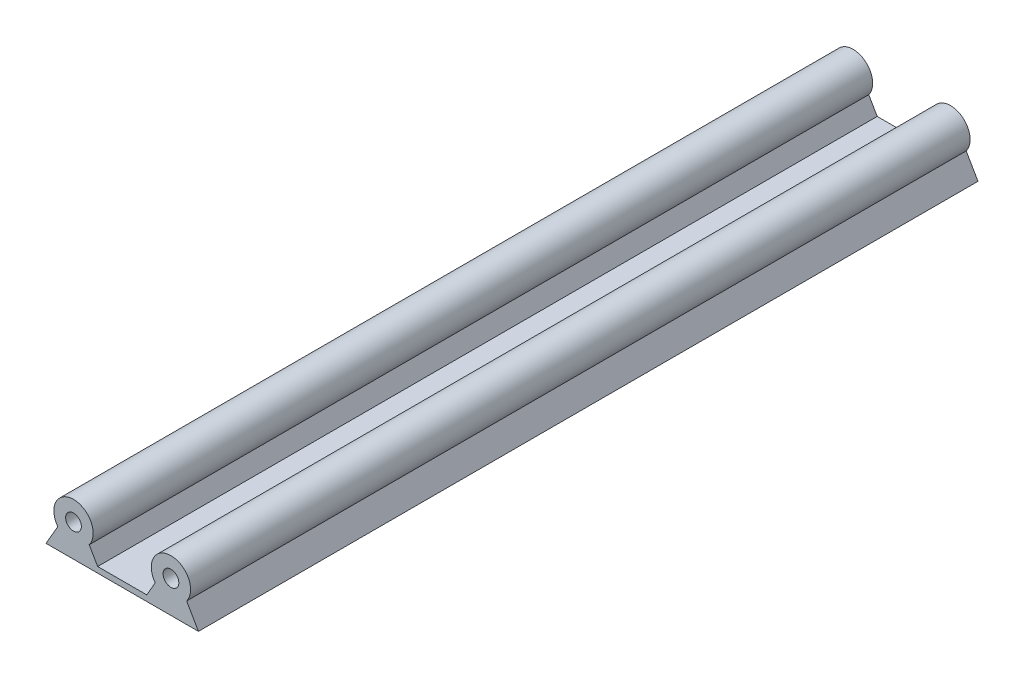
ISO-10303-21;
HEADER;
FILE_DESCRIPTION(('STEP AP214'),'2;1');
FILE_NAME('part.step','',(''),(''),'','','');
FILE_SCHEMA(('AUTOMOTIVE_DESIGN { 1 0 10303 214 1 1 1 1 }'));
ENDSEC;
DATA;
#1=APPLICATION_CONTEXT('core data for automotive mechanical design processes');
#2=APPLICATION_PROTOCOL_DEFINITION('international standard','automotive_design',2000,#1);
#3=PRODUCT_CONTEXT('',#1,'mechanical');
#4=PRODUCT('Part','Part','',(#3));
#5=PRODUCT_RELATED_PRODUCT_CATEGORY('part','',(#4));
#6=PRODUCT_DEFINITION_FORMATION('','',#4);
#7=PRODUCT_DEFINITION_CONTEXT('part definition',#1,'design');
#8=PRODUCT_DEFINITION('design','',#6,#7);
#9=PRODUCT_DEFINITION_SHAPE('','',#8);
#10=(LENGTH_UNIT() NAMED_UNIT(*) SI_UNIT(.MILLI.,.METRE.));
#11=(NAMED_UNIT(*) PLANE_ANGLE_UNIT() SI_UNIT($,.RADIAN.));
#12=(NAMED_UNIT(*) SI_UNIT($,.STERADIAN.) SOLID_ANGLE_UNIT());
#13=UNCERTAINTY_MEASURE_WITH_UNIT(LENGTH_MEASURE(1.E-05),#10,'distance_accuracy_value','');
#14=(GEOMETRIC_REPRESENTATION_CONTEXT(3) GLOBAL_UNCERTAINTY_ASSIGNED_CONTEXT((#13)) GLOBAL_UNIT_ASSIGNED_CONTEXT((#10,
#11,#12)) REPRESENTATION_CONTEXT('',''));
#15=CARTESIAN_POINT('',(0.,0.,0.));
#16=DIRECTION('',(0.,0.,1.));
#17=DIRECTION('',(1.,0.,0.));
#18=AXIS2_PLACEMENT_3D('',#15,#16,#17);
#19=CARTESIAN_POINT('',(0.,0.,220.));
#20=DIRECTION('',(0.,0.,-1.));
#21=DIRECTION('',(-1.,0.,0.));
#22=AXIS2_PLACEMENT_3D('',#19,#20,#21);
#23=CYLINDRICAL_SURFACE('',#22,5.);
#24=CARTESIAN_POINT('',(0.,0.,209.2));
#25=DIRECTION('',(0.,0.,1.));
#26=DIRECTION('',(1.,0.,0.));
#27=AXIS2_PLACEMENT_3D('',#24,#25,#26);
#28=CIRCLE('',#27,5.);
#29=CARTESIAN_POINT('',(4.,-3.,209.2));
#30=VERTEX_POINT('',#29);
#31=CARTESIAN_POINT('',(-4.,-3.,209.2));
#32=VERTEX_POINT('',#31);
#33=EDGE_CURVE('E198',#30,#32,#28,.T.);
#34=ORIENTED_EDGE('',*,*,#33,.F.);
#35=DIRECTION('',(0.,0.,-1.));
#36=VECTOR('',#35,1.);
#37=CARTESIAN_POINT('',(4.,-3.,220.));
#38=LINE('',#37,#36);
#39=CARTESIAN_POINT('',(4.,-3.,10.8));
#40=VERTEX_POINT('',#39);
#41=EDGE_CURVE('E148',#30,#40,#38,.T.);
#42=ORIENTED_EDGE('',*,*,#41,.T.);
#43=CARTESIAN_POINT('',(0.,0.,10.8));
#44=DIRECTION('',(0.,0.,-1.));
#45=DIRECTION('',(-1.,0.,0.));
#46=AXIS2_PLACEMENT_3D('',#43,#44,#45);
#47=CIRCLE('',#46,5.);
#48=CARTESIAN_POINT('',(-4.,-3.,10.8));
#49=VERTEX_POINT('',#48);
#50=EDGE_CURVE('E177',#49,#40,#47,.T.);
#51=ORIENTED_EDGE('',*,*,#50,.F.);
#52=DIRECTION('',(0.,0.,-1.));
#53=VECTOR('',#52,1.);
#54=CARTESIAN_POINT('',(-4.,-3.,220.));
#55=LINE('',#54,#53);
#56=EDGE_CURVE('E11',#32,#49,#55,.T.);
#57=ORIENTED_EDGE('',*,*,#56,.F.);
#58=EDGE_LOOP('',(#34,#42,#51,#57));
#59=FACE_BOUND('',#58,.T.);
#60=ADVANCED_FACE('F47',(#59),#23,.T.);
#61=CARTESIAN_POINT('',(-1.70096189432334,0.982050807568877,220.));
#62=DIRECTION('',(0.866025403784438,-0.5,0.));
#63=DIRECTION('',(0.5,0.866025403784439,0.));
#64=AXIS2_PLACEMENT_3D('',#61,#62,#63);
#65=PLANE('',#64);
#66=DIRECTION('',(-0.5,-0.866025403784439,0.));
#67=VECTOR('',#66,1.);
#68=CARTESIAN_POINT('',(-4.,-3.,209.2));
#69=LINE('',#68,#67);
#70=CARTESIAN_POINT('',(-7.,-8.19615242270663,209.2));
#71=VERTEX_POINT('',#70);
#72=EDGE_CURVE('E203',#32,#71,#69,.T.);
#73=ORIENTED_EDGE('',*,*,#72,.F.);
#74=ORIENTED_EDGE('',*,*,#56,.T.);
#75=DIRECTION('',(0.5,0.866025403784439,0.));
#76=VECTOR('',#75,1.);
#77=CARTESIAN_POINT('',(-7.,-8.19615242270663,10.8));
#78=LINE('',#77,#76);
#79=CARTESIAN_POINT('',(-7.,-8.19615242270663,10.8));
#80=VERTEX_POINT('',#79);
#81=EDGE_CURVE('E168',#80,#49,#78,.T.);
#82=ORIENTED_EDGE('',*,*,#81,.F.);
#83=DIRECTION('',(0.,0.,-1.));
#84=VECTOR('',#83,1.);
#85=CARTESIAN_POINT('',(-7.,-8.19615242270663,220.));
#86=LINE('',#85,#84);
#87=EDGE_CURVE('E55',#71,#80,#86,.T.);
#88=ORIENTED_EDGE('',*,*,#87,.F.);
#89=EDGE_LOOP('',(#73,#74,#82,#88));
#90=FACE_BOUND('',#89,.T.);
#91=ADVANCED_FACE('F174',(#90),#65,.F.);
#92=CARTESIAN_POINT('',(0.,-8.19615242270663,220.));
#93=DIRECTION('',(0.,1.,0.));
#94=DIRECTION('',(0.,0.,1.));
#95=AXIS2_PLACEMENT_3D('',#92,#93,#94);
#96=PLANE('',#95);
#97=CARTESIAN_POINT('',(24.8000000000093,-8.19615242270663,23.2000000000003));
#98=DIRECTION('',(0.,-1.,0.));
#99=DIRECTION('',(0.,0.,-1.));
#100=AXIS2_PLACEMENT_3D('',#97,#98,#99);
#101=CIRCLE('',#100,3.2);
#102=CARTESIAN_POINT('',(24.8000000000093,-8.19615242270663,20.0000000000003));
#103=VERTEX_POINT('',#102);
#104=EDGE_CURVE('E250',#103,#103,#101,.T.);
#105=ORIENTED_EDGE('',*,*,#104,.F.);
#106=EDGE_LOOP('',(#105));
#107=FACE_BOUND('',#106,.T.);
#108=CARTESIAN_POINT('',(0.,-8.19615242270663,198.2));
#109=DIRECTION('',(0.,-1.,0.));
#110=DIRECTION('',(0.,0.,-1.));
#111=AXIS2_PLACEMENT_3D('',#108,#109,#110);
#112=CIRCLE('',#111,3.20000000000001);
#113=CARTESIAN_POINT('',(0.,-8.19615242270663,195.));
#114=VERTEX_POINT('',#113);
#115=EDGE_CURVE('E254',#114,#114,#112,.T.);
#116=ORIENTED_EDGE('',*,*,#115,.F.);
#117=EDGE_LOOP('',(#116));
#118=FACE_BOUND('',#117,.T.);
#119=CARTESIAN_POINT('',(24.8,-8.19615242270663,198.2));
#120=DIRECTION('',(0.,-1.,0.));
#121=DIRECTION('',(0.,0.,-1.));
#122=AXIS2_PLACEMENT_3D('',#119,#120,#121);
#123=CIRCLE('',#122,3.2);
#124=CARTESIAN_POINT('',(24.8,-8.19615242270663,195.));
#125=VERTEX_POINT('',#124);
#126=EDGE_CURVE('E258',#125,#125,#123,.T.);
#127=ORIENTED_EDGE('',*,*,#126,.F.);
#128=EDGE_LOOP('',(#127));
#129=FACE_BOUND('',#128,.T.);
#130=CARTESIAN_POINT('',(9.28301076888116E-12,-8.19615242270663,23.2));
#131=DIRECTION('',(0.,-1.,0.));
#132=DIRECTION('',(0.,0.,-1.));
#133=AXIS2_PLACEMENT_3D('',#130,#131,#132);
#134=CIRCLE('',#133,3.2);
#135=CARTESIAN_POINT('',(9.28301076888116E-12,-8.19615242270663,20.));
#136=VERTEX_POINT('',#135);
#137=EDGE_CURVE('E261',#136,#136,#134,.T.);
#138=ORIENTED_EDGE('',*,*,#137,.F.);
#139=EDGE_LOOP('',(#138));
#140=FACE_BOUND('',#139,.T.);
#141=DIRECTION('',(1.,0.,0.));
#142=VECTOR('',#141,1.);
#143=CARTESIAN_POINT('',(-7.,-8.19615242270663,209.2));
#144=LINE('',#143,#142);
#145=CARTESIAN_POINT('',(31.8,-8.19615242270663,209.2));
#146=VERTEX_POINT('',#145);
#147=EDGE_CURVE('E62',#71,#146,#144,.T.);
#148=ORIENTED_EDGE('',*,*,#147,.F.);
#149=ORIENTED_EDGE('',*,*,#87,.T.);
#150=DIRECTION('',(-1.,0.,0.));
#151=VECTOR('',#150,1.);
#152=CARTESIAN_POINT('',(31.8,-8.19615242270663,10.8));
#153=LINE('',#152,#151);
#154=CARTESIAN_POINT('',(31.8,-8.19615242270663,10.8));
#155=VERTEX_POINT('',#154);
#156=EDGE_CURVE('E159',#155,#80,#153,.T.);
#157=ORIENTED_EDGE('',*,*,#156,.F.);
#158=DIRECTION('',(0.,0.,-1.));
#159=VECTOR('',#158,1.);
#160=CARTESIAN_POINT('',(31.8,-8.19615242270663,220.));
#161=LINE('',#160,#159);
#162=EDGE_CURVE('E134',#146,#155,#161,.T.);
#163=ORIENTED_EDGE('',*,*,#162,.F.);
#164=EDGE_LOOP('',(#148,#149,#157,#163));
#165=FACE_BOUND('',#164,.T.);
#166=ADVANCED_FACE('F157',(#107,#118,#129,#140,#165),#96,.F.);
#167=CARTESIAN_POINT('',(1.70096189432334,0.982050807568877,220.));
#168=DIRECTION('',(0.866025403784438,0.5,0.));
#169=DIRECTION('',(-0.5,0.866025403784439,0.));
#170=AXIS2_PLACEMENT_3D('',#167,#168,#169);
#171=PLANE('',#170);
#172=ORIENTED_EDGE('',*,*,#41,.F.);
#173=DIRECTION('',(-0.5,0.866025403784439,0.));
#174=VECTOR('',#173,1.);
#175=CARTESIAN_POINT('',(6.15,-6.72390923627308,209.2));
#176=LINE('',#175,#174);
#177=CARTESIAN_POINT('',(6.15,-6.72390923627308,209.2));
#178=VERTEX_POINT('',#177);
#179=EDGE_CURVE('E195',#178,#30,#176,.T.);
#180=ORIENTED_EDGE('',*,*,#179,.F.);
#181=DIRECTION('',(0.,0.,1.));
#182=VECTOR('',#181,1.);
#183=CARTESIAN_POINT('',(6.15,-6.72390923627308,0.));
#184=LINE('',#183,#182);
#185=CARTESIAN_POINT('',(6.15,-6.72390923627308,10.8));
#186=VERTEX_POINT('',#185);
#187=EDGE_CURVE('E144',#186,#178,#184,.T.);
#188=ORIENTED_EDGE('',*,*,#187,.F.);
#189=DIRECTION('',(0.5,-0.866025403784439,0.));
#190=VECTOR('',#189,1.);
#191=CARTESIAN_POINT('',(4.,-3.,10.8));
#192=LINE('',#191,#190);
#193=EDGE_CURVE('E180',#40,#186,#192,.T.);
#194=ORIENTED_EDGE('',*,*,#193,.F.);
#195=EDGE_LOOP('',(#172,#180,#188,#194));
#196=FACE_BOUND('',#195,.T.);
#197=ADVANCED_FACE('F233',(#196),#171,.T.);
#198=CARTESIAN_POINT('',(6.15,-6.72390923627308,0.));
#199=DIRECTION('',(0.,1.,0.));
#200=DIRECTION('',(-1.,0.,0.));
#201=AXIS2_PLACEMENT_3D('',#198,#199,#200);
#202=PLANE('',#201);
#203=ORIENTED_EDGE('',*,*,#187,.T.);
#204=DIRECTION('',(-1.,0.,0.));
#205=VECTOR('',#204,1.);
#206=CARTESIAN_POINT('',(18.65,-6.72390923627309,209.2));
#207=LINE('',#206,#205);
#208=CARTESIAN_POINT('',(18.65,-6.72390923627309,209.2));
#209=VERTEX_POINT('',#208);
#210=EDGE_CURVE('E129',#209,#178,#207,.T.);
#211=ORIENTED_EDGE('',*,*,#210,.F.);
#212=DIRECTION('',(0.,0.,1.));
#213=VECTOR('',#212,1.);
#214=CARTESIAN_POINT('',(18.65,-6.72390923627309,0.));
#215=LINE('',#214,#213);
#216=CARTESIAN_POINT('',(18.65,-6.72390923627309,10.8));
#217=VERTEX_POINT('',#216);
#218=EDGE_CURVE('E127',#217,#209,#215,.T.);
#219=ORIENTED_EDGE('',*,*,#218,.F.);
#220=DIRECTION('',(1.,0.,0.));
#221=VECTOR('',#220,1.);
#222=CARTESIAN_POINT('',(6.15,-6.72390923627308,10.8));
#223=LINE('',#222,#221);
#224=EDGE_CURVE('E140',#186,#217,#223,.T.);
#225=ORIENTED_EDGE('',*,*,#224,.F.);
#226=EDGE_LOOP('',(#203,#211,#219,#225));
#227=FACE_BOUND('',#226,.T.);
#228=ADVANCED_FACE('F192',(#227),#202,.T.);
#229=CARTESIAN_POINT('',(24.8,0.,220.));
#230=DIRECTION('',(0.,0.,-1.));
#231=DIRECTION('',(-1.,0.,0.));
#232=AXIS2_PLACEMENT_3D('',#229,#230,#231);
#233=CYLINDRICAL_SURFACE('',#232,5.);
#234=DIRECTION('',(0.,0.,-1.));
#235=VECTOR('',#234,1.);
#236=CARTESIAN_POINT('',(20.8,-3.,220.));
#237=LINE('',#236,#235);
#238=CARTESIAN_POINT('',(20.8,-3.,209.2));
#239=VERTEX_POINT('',#238);
#240=CARTESIAN_POINT('',(20.8,-3.,10.8));
#241=VERTEX_POINT('',#240);
#242=EDGE_CURVE('E124',#239,#241,#237,.T.);
#243=ORIENTED_EDGE('',*,*,#242,.F.);
#244=CARTESIAN_POINT('',(24.8,0.,209.2));
#245=DIRECTION('',(0.,0.,1.));
#246=DIRECTION('',(1.,0.,0.));
#247=AXIS2_PLACEMENT_3D('',#244,#245,#246);
#248=CIRCLE('',#247,5.);
#249=CARTESIAN_POINT('',(28.8,-3.,209.2));
#250=VERTEX_POINT('',#249);
#251=EDGE_CURVE('E110',#250,#239,#248,.T.);
#252=ORIENTED_EDGE('',*,*,#251,.F.);
#253=DIRECTION('',(0.,0.,-1.));
#254=VECTOR('',#253,1.);
#255=CARTESIAN_POINT('',(28.8,-3.,220.));
#256=LINE('',#255,#254);
#257=CARTESIAN_POINT('',(28.8,-3.,10.8));
#258=VERTEX_POINT('',#257);
#259=EDGE_CURVE('E70',#250,#258,#256,.T.);
#260=ORIENTED_EDGE('',*,*,#259,.T.);
#261=CARTESIAN_POINT('',(24.8,0.,10.8));
#262=DIRECTION('',(0.,0.,-1.));
#263=DIRECTION('',(-1.,0.,0.));
#264=AXIS2_PLACEMENT_3D('',#261,#262,#263);
#265=CIRCLE('',#264,5.);
#266=EDGE_CURVE('E132',#241,#258,#265,.T.);
#267=ORIENTED_EDGE('',*,*,#266,.F.);
#268=EDGE_LOOP('',(#243,#252,#260,#267));
#269=FACE_BOUND('',#268,.T.);
#270=ADVANCED_FACE('F131',(#269),#233,.T.);
#271=CARTESIAN_POINT('',(20.8,-3.,220.));
#272=DIRECTION('',(0.866025403784439,-0.5,0.));
#273=DIRECTION('',(0.5,0.866025403784439,0.));
#274=AXIS2_PLACEMENT_3D('',#271,#272,#273);
#275=PLANE('',#274);
#276=DIRECTION('',(-0.5,-0.866025403784439,0.));
#277=VECTOR('',#276,1.);
#278=CARTESIAN_POINT('',(20.8,-3.,209.2));
#279=LINE('',#278,#277);
#280=EDGE_CURVE('E113',#239,#209,#279,.T.);
#281=ORIENTED_EDGE('',*,*,#280,.F.);
#282=ORIENTED_EDGE('',*,*,#242,.T.);
#283=DIRECTION('',(0.5,0.866025403784439,0.));
#284=VECTOR('',#283,1.);
#285=CARTESIAN_POINT('',(18.65,-6.72390923627309,10.8));
#286=LINE('',#285,#284);
#287=EDGE_CURVE('E135',#217,#241,#286,.T.);
#288=ORIENTED_EDGE('',*,*,#287,.F.);
#289=ORIENTED_EDGE('',*,*,#218,.T.);
#290=EDGE_LOOP('',(#281,#282,#288,#289));
#291=FACE_BOUND('',#290,.T.);
#292=ADVANCED_FACE('F122',(#291),#275,.F.);
#293=CARTESIAN_POINT('',(28.8,-3.,220.));
#294=DIRECTION('',(0.866025403784438,0.5,0.));
#295=DIRECTION('',(-0.5,0.866025403784438,0.));
#296=AXIS2_PLACEMENT_3D('',#293,#294,#295);
#297=PLANE('',#296);
#298=ORIENTED_EDGE('',*,*,#259,.F.);
#299=DIRECTION('',(-0.5,0.866025403784438,0.));
#300=VECTOR('',#299,1.);
#301=CARTESIAN_POINT('',(31.8,-8.19615242270663,209.2));
#302=LINE('',#301,#300);
#303=EDGE_CURVE('E115',#146,#250,#302,.T.);
#304=ORIENTED_EDGE('',*,*,#303,.F.);
#305=ORIENTED_EDGE('',*,*,#162,.T.);
#306=DIRECTION('',(0.5,-0.866025403784438,0.));
#307=VECTOR('',#306,1.);
#308=CARTESIAN_POINT('',(28.8,-3.,10.8));
#309=LINE('',#308,#307);
#310=EDGE_CURVE('E171',#258,#155,#309,.T.);
#311=ORIENTED_EDGE('',*,*,#310,.F.);
#312=EDGE_LOOP('',(#298,#304,#305,#311));
#313=FACE_BOUND('',#312,.T.);
#314=ADVANCED_FACE('F213',(#313),#297,.T.);
#315=CARTESIAN_POINT('',(24.8,0.,10.8));
#316=DIRECTION('',(0.,0.,-1.));
#317=DIRECTION('',(-1.,0.,0.));
#318=AXIS2_PLACEMENT_3D('',#315,#316,#317);
#319=PLANE('',#318);
#320=CARTESIAN_POINT('',(0.,0.,10.8));
#321=DIRECTION('',(0.,0.,-1.));
#322=DIRECTION('',(-1.,0.,0.));
#323=AXIS2_PLACEMENT_3D('',#320,#321,#322);
#324=CIRCLE('',#323,1.5);
#325=CARTESIAN_POINT('',(-1.5,0.,10.8));
#326=VERTEX_POINT('',#325);
#327=EDGE_CURVE('E281',#326,#326,#324,.T.);
#328=ORIENTED_EDGE('',*,*,#327,.F.);
#329=EDGE_LOOP('',(#328));
#330=FACE_BOUND('',#329,.T.);
#331=CARTESIAN_POINT('',(24.8,-1.73177474406619E-13,10.8));
#332=DIRECTION('',(0.,0.,-1.));
#333=DIRECTION('',(-1.,0.,0.));
#334=AXIS2_PLACEMENT_3D('',#331,#332,#333);
#335=CIRCLE('',#334,1.5);
#336=CARTESIAN_POINT('',(23.3,-1.73177474406619E-13,10.8));
#337=VERTEX_POINT('',#336);
#338=EDGE_CURVE('E285',#337,#337,#335,.T.);
#339=ORIENTED_EDGE('',*,*,#338,.F.);
#340=EDGE_LOOP('',(#339));
#341=FACE_BOUND('',#340,.T.);
#342=ORIENTED_EDGE('',*,*,#266,.T.);
#343=ORIENTED_EDGE('',*,*,#310,.T.);
#344=ORIENTED_EDGE('',*,*,#156,.T.);
#345=ORIENTED_EDGE('',*,*,#81,.T.);
#346=ORIENTED_EDGE('',*,*,#50,.T.);
#347=ORIENTED_EDGE('',*,*,#193,.T.);
#348=ORIENTED_EDGE('',*,*,#224,.T.);
#349=ORIENTED_EDGE('',*,*,#287,.T.);
#350=EDGE_LOOP('',(#342,#343,#344,#345,#346,#347,#348,#349));
#351=FACE_BOUND('',#350,.T.);
#352=ADVANCED_FACE('F166',(#330,#341,#351),#319,.T.);
#353=CARTESIAN_POINT('',(24.8,0.,209.2));
#354=DIRECTION('',(0.,0.,1.));
#355=DIRECTION('',(1.,0.,0.));
#356=AXIS2_PLACEMENT_3D('',#353,#354,#355);
#357=PLANE('',#356);
#358=CARTESIAN_POINT('',(0.,0.,209.2));
#359=DIRECTION('',(0.,0.,1.));
#360=DIRECTION('',(1.,0.,0.));
#361=AXIS2_PLACEMENT_3D('',#358,#359,#360);
#362=CIRCLE('',#361,2.);
#363=CARTESIAN_POINT('',(2.,0.,209.2));
#364=VERTEX_POINT('',#363);
#365=EDGE_CURVE('E295',#364,#364,#362,.T.);
#366=ORIENTED_EDGE('',*,*,#365,.F.);
#367=EDGE_LOOP('',(#366));
#368=FACE_BOUND('',#367,.T.);
#369=CARTESIAN_POINT('',(24.8,0.,209.2));
#370=DIRECTION('',(0.,0.,1.));
#371=DIRECTION('',(1.,0.,0.));
#372=AXIS2_PLACEMENT_3D('',#369,#370,#371);
#373=CIRCLE('',#372,2.);
#374=CARTESIAN_POINT('',(26.8,0.,209.2));
#375=VERTEX_POINT('',#374);
#376=EDGE_CURVE('E299',#375,#375,#373,.T.);
#377=ORIENTED_EDGE('',*,*,#376,.F.);
#378=EDGE_LOOP('',(#377));
#379=FACE_BOUND('',#378,.T.);
#380=ORIENTED_EDGE('',*,*,#251,.T.);
#381=ORIENTED_EDGE('',*,*,#280,.T.);
#382=ORIENTED_EDGE('',*,*,#210,.T.);
#383=ORIENTED_EDGE('',*,*,#179,.T.);
#384=ORIENTED_EDGE('',*,*,#33,.T.);
#385=ORIENTED_EDGE('',*,*,#72,.T.);
#386=ORIENTED_EDGE('',*,*,#147,.T.);
#387=ORIENTED_EDGE('',*,*,#303,.T.);
#388=EDGE_LOOP('',(#380,#381,#382,#383,#384,#385,#386,#387));
#389=FACE_BOUND('',#388,.T.);
#390=ADVANCED_FACE('F112',(#368,#379,#389),#357,.T.);
#391=CARTESIAN_POINT('',(24.8,0.,202.2));
#392=DIRECTION('',(0.,0.,1.));
#393=DIRECTION('',(1.,0.,0.));
#394=AXIS2_PLACEMENT_3D('',#391,#392,#393);
#395=CYLINDRICAL_SURFACE('',#394,2.);
#396=CARTESIAN_POINT('',(24.8,0.,202.2));
#397=DIRECTION('',(0.,0.,1.));
#398=DIRECTION('',(1.,0.,0.));
#399=AXIS2_PLACEMENT_3D('',#396,#397,#398);
#400=CIRCLE('',#399,2.);
#401=CARTESIAN_POINT('',(26.8,0.,202.2));
#402=VERTEX_POINT('',#401);
#403=EDGE_CURVE('E280',#402,#402,#400,.T.);
#404=ORIENTED_EDGE('',*,*,#403,.F.);
#405=EDGE_LOOP('',(#404));
#406=FACE_BOUND('',#405,.T.);
#407=ORIENTED_EDGE('',*,*,#376,.T.);
#408=EDGE_LOOP('',(#407));
#409=FACE_BOUND('',#408,.T.);
#410=ADVANCED_FACE('F309',(#406,#409),#395,.F.);
#411=CARTESIAN_POINT('',(24.8,0.,202.2));
#412=DIRECTION('',(0.,0.,1.));
#413=DIRECTION('',(1.,0.,0.));
#414=AXIS2_PLACEMENT_3D('',#411,#412,#413);
#415=PLANE('',#414);
#416=ORIENTED_EDGE('',*,*,#403,.T.);
#417=EDGE_LOOP('',(#416));
#418=FACE_BOUND('',#417,.T.);
#419=ADVANCED_FACE('F307',(#418),#415,.T.);
#420=CARTESIAN_POINT('',(0.,0.,202.2));
#421=DIRECTION('',(0.,0.,1.));
#422=DIRECTION('',(1.,0.,0.));
#423=AXIS2_PLACEMENT_3D('',#420,#421,#422);
#424=CYLINDRICAL_SURFACE('',#423,2.);
#425=CARTESIAN_POINT('',(0.,0.,202.2));
#426=DIRECTION('',(0.,0.,1.));
#427=DIRECTION('',(1.,0.,0.));
#428=AXIS2_PLACEMENT_3D('',#425,#426,#427);
#429=CIRCLE('',#428,2.);
#430=CARTESIAN_POINT('',(2.,0.,202.2));
#431=VERTEX_POINT('',#430);
#432=EDGE_CURVE('E118',#431,#431,#429,.T.);
#433=ORIENTED_EDGE('',*,*,#432,.F.);
#434=EDGE_LOOP('',(#433));
#435=FACE_BOUND('',#434,.T.);
#436=ORIENTED_EDGE('',*,*,#365,.T.);
#437=EDGE_LOOP('',(#436));
#438=FACE_BOUND('',#437,.T.);
#439=ADVANCED_FACE('F467',(#435,#438),#424,.F.);
#440=CARTESIAN_POINT('',(0.,0.,202.2));
#441=DIRECTION('',(0.,0.,1.));
#442=DIRECTION('',(1.,0.,0.));
#443=AXIS2_PLACEMENT_3D('',#440,#441,#442);
#444=PLANE('',#443);
#445=ORIENTED_EDGE('',*,*,#432,.T.);
#446=EDGE_LOOP('',(#445));
#447=FACE_BOUND('',#446,.T.);
#448=ADVANCED_FACE('F347',(#447),#444,.T.);
#449=CARTESIAN_POINT('',(24.8,-1.73177474406619E-13,17.8));
#450=DIRECTION('',(0.,0.,-1.));
#451=DIRECTION('',(-1.,0.,0.));
#452=AXIS2_PLACEMENT_3D('',#449,#450,#451);
#453=CYLINDRICAL_SURFACE('',#452,1.5);
#454=CARTESIAN_POINT('',(24.8,-1.73177474406619E-13,17.8));
#455=DIRECTION('',(0.,0.,-1.));
#456=DIRECTION('',(-1.,0.,0.));
#457=AXIS2_PLACEMENT_3D('',#454,#455,#456);
#458=CIRCLE('',#457,1.5);
#459=CARTESIAN_POINT('',(23.3,-1.73177474406619E-13,17.8));
#460=VERTEX_POINT('',#459);
#461=EDGE_CURVE('E270',#460,#460,#458,.T.);
#462=ORIENTED_EDGE('',*,*,#461,.F.);
#463=EDGE_LOOP('',(#462));
#464=FACE_BOUND('',#463,.T.);
#465=ORIENTED_EDGE('',*,*,#338,.T.);
#466=EDGE_LOOP('',(#465));
#467=FACE_BOUND('',#466,.T.);
#468=ADVANCED_FACE('F351',(#464,#467),#453,.F.);
#469=CARTESIAN_POINT('',(24.8,-1.73177474406619E-13,17.8));
#470=DIRECTION('',(0.,0.,-1.));
#471=DIRECTION('',(-1.,0.,0.));
#472=AXIS2_PLACEMENT_3D('',#469,#470,#471);
#473=PLANE('',#472);
#474=ORIENTED_EDGE('',*,*,#461,.T.);
#475=EDGE_LOOP('',(#474));
#476=FACE_BOUND('',#475,.T.);
#477=ADVANCED_FACE('F355',(#476),#473,.T.);
#478=CARTESIAN_POINT('',(0.,0.,17.8));
#479=DIRECTION('',(0.,0.,-1.));
#480=DIRECTION('',(-1.,0.,0.));
#481=AXIS2_PLACEMENT_3D('',#478,#479,#480);
#482=CYLINDRICAL_SURFACE('',#481,1.5);
#483=CARTESIAN_POINT('',(0.,0.,17.8));
#484=DIRECTION('',(0.,0.,-1.));
#485=DIRECTION('',(-1.,0.,0.));
#486=AXIS2_PLACEMENT_3D('',#483,#484,#485);
#487=CIRCLE('',#486,1.5);
#488=CARTESIAN_POINT('',(-1.5,0.,17.8));
#489=VERTEX_POINT('',#488);
#490=EDGE_CURVE('E276',#489,#489,#487,.T.);
#491=ORIENTED_EDGE('',*,*,#490,.F.);
#492=EDGE_LOOP('',(#491));
#493=FACE_BOUND('',#492,.T.);
#494=ORIENTED_EDGE('',*,*,#327,.T.);
#495=EDGE_LOOP('',(#494));
#496=FACE_BOUND('',#495,.T.);
#497=ADVANCED_FACE('F364',(#493,#496),#482,.F.);
#498=CARTESIAN_POINT('',(0.,0.,17.8));
#499=DIRECTION('',(0.,0.,-1.));
#500=DIRECTION('',(-1.,0.,0.));
#501=AXIS2_PLACEMENT_3D('',#498,#499,#500);
#502=PLANE('',#501);
#503=ORIENTED_EDGE('',*,*,#490,.T.);
#504=EDGE_LOOP('',(#503));
#505=FACE_BOUND('',#504,.T.);
#506=ADVANCED_FACE('F372',(#505),#502,.T.);
#507=CARTESIAN_POINT('',(9.28301076888116E-12,-3.19615242270663,23.2));
#508=DIRECTION('',(0.,-1.,0.));
#509=DIRECTION('',(0.,0.,-1.));
#510=AXIS2_PLACEMENT_3D('',#507,#508,#509);
#511=CYLINDRICAL_SURFACE('',#510,3.2);
#512=CARTESIAN_POINT('',(9.28301076888116E-12,-3.19615242270663,23.2));
#513=DIRECTION('',(0.,-1.,0.));
#514=DIRECTION('',(0.,0.,-1.));
#515=AXIS2_PLACEMENT_3D('',#512,#513,#514);
#516=CIRCLE('',#515,3.2);
#517=CARTESIAN_POINT('',(9.28301076888116E-12,-3.19615242270663,20.));
#518=VERTEX_POINT('',#517);
#519=EDGE_CURVE('E264',#518,#518,#516,.T.);
#520=ORIENTED_EDGE('',*,*,#519,.F.);
#521=EDGE_LOOP('',(#520));
#522=FACE_BOUND('',#521,.T.);
#523=ORIENTED_EDGE('',*,*,#137,.T.);
#524=EDGE_LOOP('',(#523));
#525=FACE_BOUND('',#524,.T.);
#526=ADVANCED_FACE('F380',(#522,#525),#511,.F.);
#527=CARTESIAN_POINT('',(0.,-3.19615242270663,0.));
#528=DIRECTION('',(0.,-1.,0.));
#529=DIRECTION('',(0.,0.,-1.));
#530=AXIS2_PLACEMENT_3D('',#527,#528,#529);
#531=PLANE('',#530);
#532=ORIENTED_EDGE('',*,*,#519,.T.);
#533=EDGE_LOOP('',(#532));
#534=FACE_BOUND('',#533,.T.);
#535=ADVANCED_FACE('F392',(#534),#531,.T.);
#536=CARTESIAN_POINT('',(24.8,-3.19615242270663,198.2));
#537=DIRECTION('',(0.,-1.,0.));
#538=DIRECTION('',(0.,0.,-1.));
#539=AXIS2_PLACEMENT_3D('',#536,#537,#538);
#540=CYLINDRICAL_SURFACE('',#539,3.2);
#541=CARTESIAN_POINT('',(24.8,-3.19615242270663,198.2));
#542=DIRECTION('',(0.,-1.,0.));
#543=DIRECTION('',(0.,0.,-1.));
#544=AXIS2_PLACEMENT_3D('',#541,#542,#543);
#545=CIRCLE('',#544,3.2);
#546=CARTESIAN_POINT('',(24.8,-3.19615242270663,195.));
#547=VERTEX_POINT('',#546);
#548=EDGE_CURVE('E550',#547,#547,#545,.T.);
#549=ORIENTED_EDGE('',*,*,#548,.F.);
#550=EDGE_LOOP('',(#549));
#551=FACE_BOUND('',#550,.T.);
#552=ORIENTED_EDGE('',*,*,#126,.T.);
#553=EDGE_LOOP('',(#552));
#554=FACE_BOUND('',#553,.T.);
#555=ADVANCED_FACE('F402',(#551,#554),#540,.F.);
#556=CARTESIAN_POINT('',(0.,-3.19615242270663,0.));
#557=DIRECTION('',(0.,-1.,0.));
#558=DIRECTION('',(0.,0.,-1.));
#559=AXIS2_PLACEMENT_3D('',#556,#557,#558);
#560=PLANE('',#559);
#561=ORIENTED_EDGE('',*,*,#548,.T.);
#562=EDGE_LOOP('',(#561));
#563=FACE_BOUND('',#562,.T.);
#564=ADVANCED_FACE('F412',(#563),#560,.T.);
#565=CARTESIAN_POINT('',(0.,-3.19615242270663,198.2));
#566=DIRECTION('',(0.,-1.,0.));
#567=DIRECTION('',(0.,0.,-1.));
#568=AXIS2_PLACEMENT_3D('',#565,#566,#567);
#569=CYLINDRICAL_SURFACE('',#568,3.20000000000001);
#570=CARTESIAN_POINT('',(0.,-3.19615242270663,198.2));
#571=DIRECTION('',(0.,-1.,0.));
#572=DIRECTION('',(0.,0.,-1.));
#573=AXIS2_PLACEMENT_3D('',#570,#571,#572);
#574=CIRCLE('',#573,3.20000000000001);
#575=CARTESIAN_POINT('',(0.,-3.19615242270663,195.));
#576=VERTEX_POINT('',#575);
#577=EDGE_CURVE('E543',#576,#576,#574,.T.);
#578=ORIENTED_EDGE('',*,*,#577,.F.);
#579=EDGE_LOOP('',(#578));
#580=FACE_BOUND('',#579,.T.);
#581=ORIENTED_EDGE('',*,*,#115,.T.);
#582=EDGE_LOOP('',(#581));
#583=FACE_BOUND('',#582,.T.);
#584=ADVANCED_FACE('F422',(#580,#583),#569,.F.);
#585=CARTESIAN_POINT('',(0.,-3.19615242270663,0.));
#586=DIRECTION('',(0.,-1.,0.));
#587=DIRECTION('',(0.,0.,-1.));
#588=AXIS2_PLACEMENT_3D('',#585,#586,#587);
#589=PLANE('',#588);
#590=ORIENTED_EDGE('',*,*,#577,.T.);
#591=EDGE_LOOP('',(#590));
#592=FACE_BOUND('',#591,.T.);
#593=ADVANCED_FACE('F432',(#592),#589,.T.);
#594=CARTESIAN_POINT('',(24.8000000000093,-3.19615242270663,23.2000000000003));
#595=DIRECTION('',(0.,-1.,0.));
#596=DIRECTION('',(0.,0.,-1.));
#597=AXIS2_PLACEMENT_3D('',#594,#595,#596);
#598=CYLINDRICAL_SURFACE('',#597,3.2);
#599=CARTESIAN_POINT('',(24.8000000000093,-3.19615242270663,23.2000000000003));
#600=DIRECTION('',(0.,-1.,0.));
#601=DIRECTION('',(0.,0.,-1.));
#602=AXIS2_PLACEMENT_3D('',#599,#600,#601);
#603=CIRCLE('',#602,3.2);
#604=CARTESIAN_POINT('',(24.8000000000093,-3.19615242270663,20.0000000000003));
#605=VERTEX_POINT('',#604);
#606=EDGE_CURVE('E265',#605,#605,#603,.T.);
#607=ORIENTED_EDGE('',*,*,#606,.F.);
#608=EDGE_LOOP('',(#607));
#609=FACE_BOUND('',#608,.T.);
#610=ORIENTED_EDGE('',*,*,#104,.T.);
#611=EDGE_LOOP('',(#610));
#612=FACE_BOUND('',#611,.T.);
#613=ADVANCED_FACE('F442',(#609,#612),#598,.F.);
#614=CARTESIAN_POINT('',(0.,-3.19615242270663,0.));
#615=DIRECTION('',(0.,-1.,0.));
#616=DIRECTION('',(0.,0.,-1.));
#617=AXIS2_PLACEMENT_3D('',#614,#615,#616);
#618=PLANE('',#617);
#619=ORIENTED_EDGE('',*,*,#606,.T.);
#620=EDGE_LOOP('',(#619));
#621=FACE_BOUND('',#620,.T.);
#622=ADVANCED_FACE('F452',(#621),#618,.T.);
#623=CLOSED_SHELL('',(#60,#91,#166,#197,#228,#270,#292,#314,#352,#390,#410,#419,#439,#448,#468,
#477,#497,#506,#526,#535,#555,#564,#584,#593,#613,#622));
#624=MANIFOLD_SOLID_BREP('B2',#623);
#625=ADVANCED_BREP_SHAPE_REPRESENTATION('',(#18,#624),#14);
#626=SHAPE_DEFINITION_REPRESENTATION(#9,#625);
ENDSEC;
END-ISO-10303-21;
